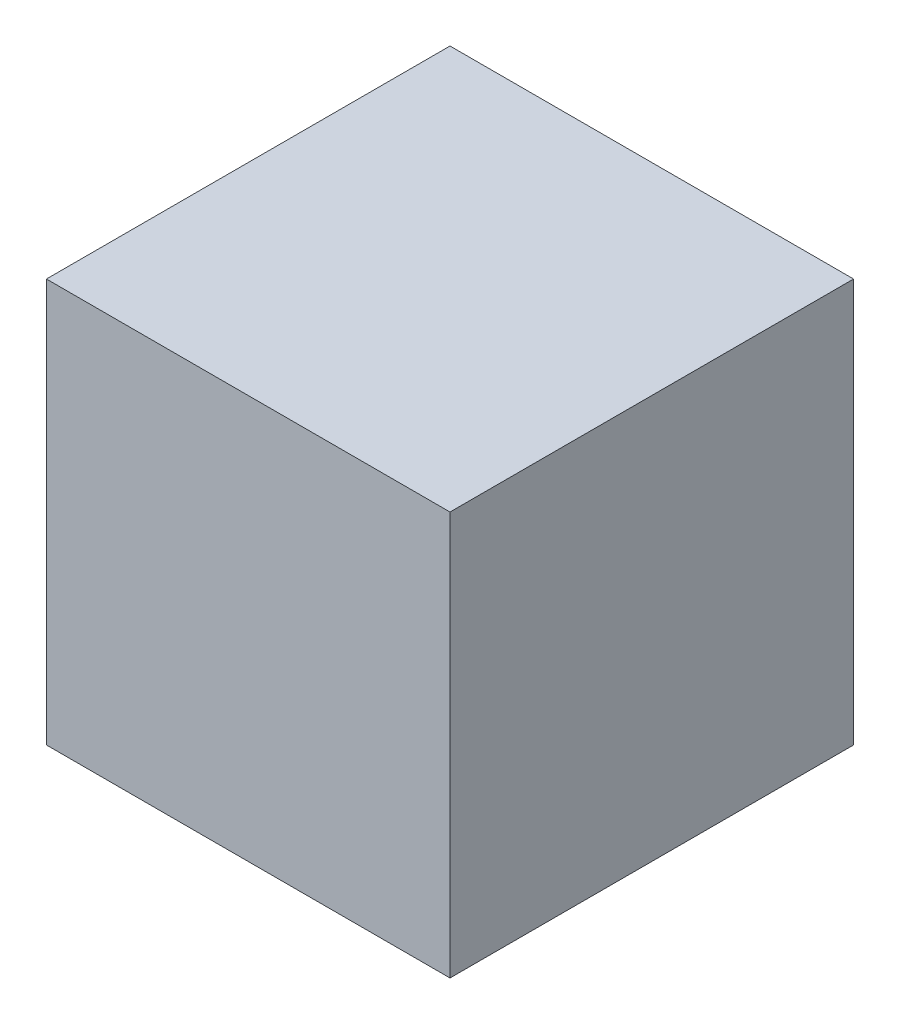
ISO-10303-21;
HEADER;
FILE_DESCRIPTION(('STEP AP214'),'2;1');
FILE_NAME('part.step','',(''),(''),'','','');
FILE_SCHEMA(('AUTOMOTIVE_DESIGN { 1 0 10303 214 1 1 1 1 }'));
ENDSEC;
DATA;
#1=APPLICATION_CONTEXT('core data for automotive mechanical design processes');
#2=APPLICATION_PROTOCOL_DEFINITION('international standard','automotive_design',2000,#1);
#3=PRODUCT_CONTEXT('',#1,'mechanical');
#4=PRODUCT('Part','Part','',(#3));
#5=PRODUCT_RELATED_PRODUCT_CATEGORY('part','',(#4));
#6=PRODUCT_DEFINITION_FORMATION('','',#4);
#7=PRODUCT_DEFINITION_CONTEXT('part definition',#1,'design');
#8=PRODUCT_DEFINITION('design','',#6,#7);
#9=PRODUCT_DEFINITION_SHAPE('','',#8);
#10=(LENGTH_UNIT() NAMED_UNIT(*) SI_UNIT(.MILLI.,.METRE.));
#11=(NAMED_UNIT(*) PLANE_ANGLE_UNIT() SI_UNIT($,.RADIAN.));
#12=(NAMED_UNIT(*) SI_UNIT($,.STERADIAN.) SOLID_ANGLE_UNIT());
#13=UNCERTAINTY_MEASURE_WITH_UNIT(LENGTH_MEASURE(1.E-05),#10,'distance_accuracy_value','');
#14=(GEOMETRIC_REPRESENTATION_CONTEXT(3) GLOBAL_UNCERTAINTY_ASSIGNED_CONTEXT((#13)) GLOBAL_UNIT_ASSIGNED_CONTEXT((#10,
#11,#12)) REPRESENTATION_CONTEXT('',''));
#15=CARTESIAN_POINT('',(0.,0.,0.));
#16=DIRECTION('',(0.,0.,1.));
#17=DIRECTION('',(1.,0.,0.));
#18=AXIS2_PLACEMENT_3D('',#15,#16,#17);
#19=CARTESIAN_POINT('',(50.,50.,50.));
#20=DIRECTION('',(-1.,0.,0.));
#21=DIRECTION('',(0.,-1.,0.));
#22=AXIS2_PLACEMENT_3D('',#19,#20,#21);
#23=PLANE('',#22);
#24=DIRECTION('',(0.,1.,0.));
#25=VECTOR('',#24,1.);
#26=CARTESIAN_POINT('',(50.,50.,-50.));
#27=LINE('',#26,#25);
#28=CARTESIAN_POINT('',(50.,-50.,-50.));
#29=VERTEX_POINT('',#28);
#30=CARTESIAN_POINT('',(50.,50.,-50.));
#31=VERTEX_POINT('',#30);
#32=EDGE_CURVE('E105',#29,#31,#27,.T.);
#33=ORIENTED_EDGE('',*,*,#32,.T.);
#34=DIRECTION('',(0.,0.,-1.));
#35=VECTOR('',#34,1.);
#36=CARTESIAN_POINT('',(50.,50.,50.));
#37=LINE('',#36,#35);
#38=CARTESIAN_POINT('',(50.,50.,50.));
#39=VERTEX_POINT('',#38);
#40=EDGE_CURVE('E11',#39,#31,#37,.T.);
#41=ORIENTED_EDGE('',*,*,#40,.F.);
#42=DIRECTION('',(0.,1.,0.));
#43=VECTOR('',#42,1.);
#44=CARTESIAN_POINT('',(50.,50.,50.));
#45=LINE('',#44,#43);
#46=CARTESIAN_POINT('',(50.,-50.,50.));
#47=VERTEX_POINT('',#46);
#48=EDGE_CURVE('E91',#47,#39,#45,.T.);
#49=ORIENTED_EDGE('',*,*,#48,.F.);
#50=DIRECTION('',(0.,0.,-1.));
#51=VECTOR('',#50,1.);
#52=CARTESIAN_POINT('',(50.,-50.,50.));
#53=LINE('',#52,#51);
#54=EDGE_CURVE('E101',#47,#29,#53,.T.);
#55=ORIENTED_EDGE('',*,*,#54,.T.);
#56=EDGE_LOOP('',(#33,#41,#49,#55));
#57=FACE_BOUND('',#56,.T.);
#58=ADVANCED_FACE('F40',(#57),#23,.F.);
#59=CARTESIAN_POINT('',(-50.,50.,50.));
#60=DIRECTION('',(0.,-1.,0.));
#61=DIRECTION('',(0.,0.,-1.));
#62=AXIS2_PLACEMENT_3D('',#59,#60,#61);
#63=PLANE('',#62);
#64=DIRECTION('',(-1.,0.,0.));
#65=VECTOR('',#64,1.);
#66=CARTESIAN_POINT('',(-50.,50.,-50.));
#67=LINE('',#66,#65);
#68=CARTESIAN_POINT('',(-50.,50.,-50.));
#69=VERTEX_POINT('',#68);
#70=EDGE_CURVE('E95',#31,#69,#67,.T.);
#71=ORIENTED_EDGE('',*,*,#70,.T.);
#72=DIRECTION('',(0.,0.,-1.));
#73=VECTOR('',#72,1.);
#74=CARTESIAN_POINT('',(-50.,50.,50.));
#75=LINE('',#74,#73);
#76=CARTESIAN_POINT('',(-50.,50.,50.));
#77=VERTEX_POINT('',#76);
#78=EDGE_CURVE('E48',#77,#69,#75,.T.);
#79=ORIENTED_EDGE('',*,*,#78,.F.);
#80=DIRECTION('',(-1.,0.,0.));
#81=VECTOR('',#80,1.);
#82=CARTESIAN_POINT('',(-50.,50.,50.));
#83=LINE('',#82,#81);
#84=EDGE_CURVE('E86',#39,#77,#83,.T.);
#85=ORIENTED_EDGE('',*,*,#84,.F.);
#86=ORIENTED_EDGE('',*,*,#40,.T.);
#87=EDGE_LOOP('',(#71,#79,#85,#86));
#88=FACE_BOUND('',#87,.T.);
#89=ADVANCED_FACE('F94',(#88),#63,.F.);
#90=CARTESIAN_POINT('',(-50.,50.,50.));
#91=DIRECTION('',(1.,0.,0.));
#92=DIRECTION('',(0.,1.,0.));
#93=AXIS2_PLACEMENT_3D('',#90,#91,#92);
#94=PLANE('',#93);
#95=DIRECTION('',(0.,-1.,0.));
#96=VECTOR('',#95,1.);
#97=CARTESIAN_POINT('',(-50.,50.,-50.));
#98=LINE('',#97,#96);
#99=CARTESIAN_POINT('',(-50.,-50.,-50.));
#100=VERTEX_POINT('',#99);
#101=EDGE_CURVE('E73',#69,#100,#98,.T.);
#102=ORIENTED_EDGE('',*,*,#101,.T.);
#103=DIRECTION('',(0.,0.,-1.));
#104=VECTOR('',#103,1.);
#105=CARTESIAN_POINT('',(-50.,-50.,50.));
#106=LINE('',#105,#104);
#107=CARTESIAN_POINT('',(-50.,-50.,50.));
#108=VERTEX_POINT('',#107);
#109=EDGE_CURVE('E96',#108,#100,#106,.T.);
#110=ORIENTED_EDGE('',*,*,#109,.F.);
#111=DIRECTION('',(0.,-1.,0.));
#112=VECTOR('',#111,1.);
#113=CARTESIAN_POINT('',(-50.,50.,50.));
#114=LINE('',#113,#112);
#115=EDGE_CURVE('E89',#77,#108,#114,.T.);
#116=ORIENTED_EDGE('',*,*,#115,.F.);
#117=ORIENTED_EDGE('',*,*,#78,.T.);
#118=EDGE_LOOP('',(#102,#110,#116,#117));
#119=FACE_BOUND('',#118,.T.);
#120=ADVANCED_FACE('F97',(#119),#94,.F.);
#121=CARTESIAN_POINT('',(-50.,-50.,50.));
#122=DIRECTION('',(0.,1.,0.));
#123=DIRECTION('',(0.,0.,1.));
#124=AXIS2_PLACEMENT_3D('',#121,#122,#123);
#125=PLANE('',#124);
#126=DIRECTION('',(1.,0.,0.));
#127=VECTOR('',#126,1.);
#128=CARTESIAN_POINT('',(-50.,-50.,-50.));
#129=LINE('',#128,#127);
#130=EDGE_CURVE('E79',#100,#29,#129,.T.);
#131=ORIENTED_EDGE('',*,*,#130,.T.);
#132=ORIENTED_EDGE('',*,*,#54,.F.);
#133=DIRECTION('',(1.,0.,0.));
#134=VECTOR('',#133,1.);
#135=CARTESIAN_POINT('',(-50.,-50.,50.));
#136=LINE('',#135,#134);
#137=EDGE_CURVE('E56',#108,#47,#136,.T.);
#138=ORIENTED_EDGE('',*,*,#137,.F.);
#139=ORIENTED_EDGE('',*,*,#109,.T.);
#140=EDGE_LOOP('',(#131,#132,#138,#139));
#141=FACE_BOUND('',#140,.T.);
#142=ADVANCED_FACE('F112',(#141),#125,.F.);
#143=CARTESIAN_POINT('',(0.,0.,50.));
#144=DIRECTION('',(0.,0.,1.));
#145=DIRECTION('',(1.,0.,0.));
#146=AXIS2_PLACEMENT_3D('',#143,#144,#145);
#147=PLANE('',#146);
#148=ORIENTED_EDGE('',*,*,#48,.T.);
#149=ORIENTED_EDGE('',*,*,#84,.T.);
#150=ORIENTED_EDGE('',*,*,#115,.T.);
#151=ORIENTED_EDGE('',*,*,#137,.T.);
#152=EDGE_LOOP('',(#148,#149,#150,#151));
#153=FACE_BOUND('',#152,.T.);
#154=ADVANCED_FACE('F87',(#153),#147,.T.);
#155=CARTESIAN_POINT('',(0.,0.,-50.));
#156=DIRECTION('',(0.,0.,1.));
#157=DIRECTION('',(1.,0.,0.));
#158=AXIS2_PLACEMENT_3D('',#155,#156,#157);
#159=PLANE('',#158);
#160=ORIENTED_EDGE('',*,*,#32,.F.);
#161=ORIENTED_EDGE('',*,*,#130,.F.);
#162=ORIENTED_EDGE('',*,*,#101,.F.);
#163=ORIENTED_EDGE('',*,*,#70,.F.);
#164=EDGE_LOOP('',(#160,#161,#162,#163));
#165=FACE_BOUND('',#164,.T.);
#166=ADVANCED_FACE('F115',(#165),#159,.F.);
#167=CLOSED_SHELL('',(#58,#89,#120,#142,#154,#166));
#168=MANIFOLD_SOLID_BREP('B2',#167);
#169=ADVANCED_BREP_SHAPE_REPRESENTATION('',(#18,#168),#14);
#170=SHAPE_DEFINITION_REPRESENTATION(#9,#169);
ENDSEC;
END-ISO-10303-21;
